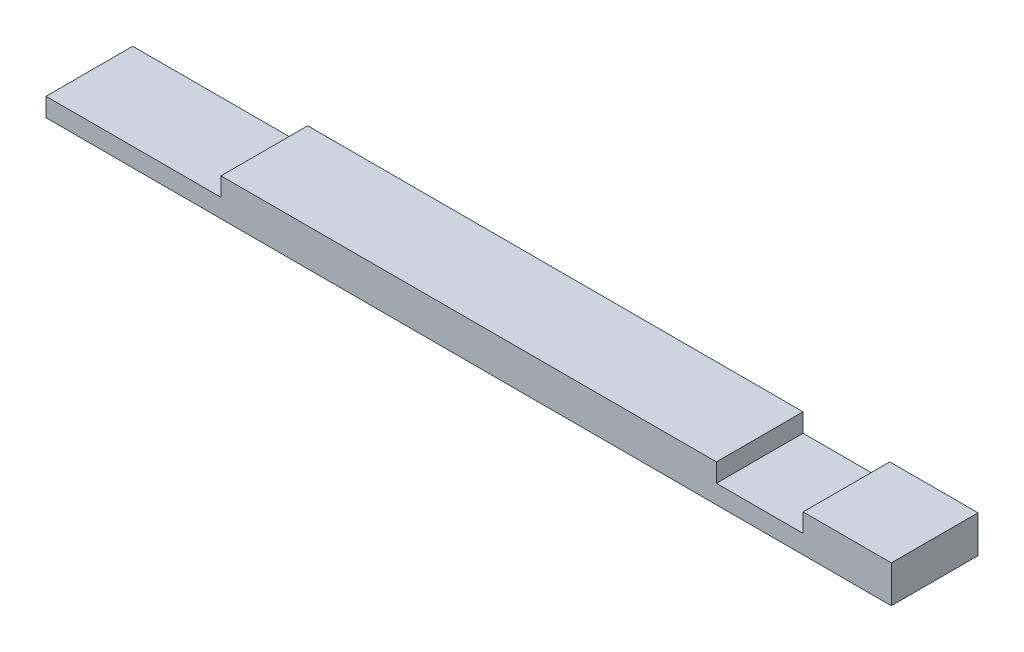
ISO-10303-21;
HEADER;
FILE_DESCRIPTION(('STEP AP214'),'2;1');
FILE_NAME('part.step','',(''),(''),'','','');
FILE_SCHEMA(('AUTOMOTIVE_DESIGN { 1 0 10303 214 1 1 1 1 }'));
ENDSEC;
DATA;
#1=APPLICATION_CONTEXT('core data for automotive mechanical design processes');
#2=APPLICATION_PROTOCOL_DEFINITION('international standard','automotive_design',2000,#1);
#3=PRODUCT_CONTEXT('',#1,'mechanical');
#4=PRODUCT('Part','Part','',(#3));
#5=PRODUCT_RELATED_PRODUCT_CATEGORY('part','',(#4));
#6=PRODUCT_DEFINITION_FORMATION('','',#4);
#7=PRODUCT_DEFINITION_CONTEXT('part definition',#1,'design');
#8=PRODUCT_DEFINITION('design','',#6,#7);
#9=PRODUCT_DEFINITION_SHAPE('','',#8);
#10=(LENGTH_UNIT() NAMED_UNIT(*) SI_UNIT(.MILLI.,.METRE.));
#11=(NAMED_UNIT(*) PLANE_ANGLE_UNIT() SI_UNIT($,.RADIAN.));
#12=(NAMED_UNIT(*) SI_UNIT($,.STERADIAN.) SOLID_ANGLE_UNIT());
#13=UNCERTAINTY_MEASURE_WITH_UNIT(LENGTH_MEASURE(1.E-05),#10,'distance_accuracy_value','');
#14=(GEOMETRIC_REPRESENTATION_CONTEXT(3) GLOBAL_UNCERTAINTY_ASSIGNED_CONTEXT((#13)) GLOBAL_UNIT_ASSIGNED_CONTEXT((#10,
#11,#12)) REPRESENTATION_CONTEXT('',''));
#15=CARTESIAN_POINT('',(0.,0.,0.));
#16=DIRECTION('',(0.,0.,1.));
#17=DIRECTION('',(1.,0.,0.));
#18=AXIS2_PLACEMENT_3D('',#15,#16,#17);
#19=CARTESIAN_POINT('',(0.,38.1,0.));
#20=DIRECTION('',(1.,0.,0.));
#21=DIRECTION('',(0.,0.,-1.));
#22=AXIS2_PLACEMENT_3D('',#19,#20,#21);
#23=PLANE('',#22);
#24=DIRECTION('',(0.,0.,1.));
#25=VECTOR('',#24,1.);
#26=CARTESIAN_POINT('',(0.,19.05,0.));
#27=LINE('',#26,#25);
#28=CARTESIAN_POINT('',(0.,19.05,-88.9));
#29=VERTEX_POINT('',#28);
#30=CARTESIAN_POINT('',(0.,19.05,0.));
#31=VERTEX_POINT('',#30);
#32=EDGE_CURVE('E161',#29,#31,#27,.T.);
#33=ORIENTED_EDGE('',*,*,#32,.F.);
#34=DIRECTION('',(0.,-1.,0.));
#35=VECTOR('',#34,1.);
#36=CARTESIAN_POINT('',(0.,38.1,-88.9));
#37=LINE('',#36,#35);
#38=CARTESIAN_POINT('',(0.,0.,-88.9));
#39=VERTEX_POINT('',#38);
#40=EDGE_CURVE('E176',#29,#39,#37,.T.);
#41=ORIENTED_EDGE('',*,*,#40,.T.);
#42=DIRECTION('',(0.,0.,1.));
#43=VECTOR('',#42,1.);
#44=CARTESIAN_POINT('',(0.,0.,0.));
#45=LINE('',#44,#43);
#46=CARTESIAN_POINT('',(0.,0.,0.));
#47=VERTEX_POINT('',#46);
#48=EDGE_CURVE('E147',#39,#47,#45,.T.);
#49=ORIENTED_EDGE('',*,*,#48,.T.);
#50=DIRECTION('',(0.,-1.,0.));
#51=VECTOR('',#50,1.);
#52=CARTESIAN_POINT('',(0.,38.1,0.));
#53=LINE('',#52,#51);
#54=EDGE_CURVE('E11',#31,#47,#53,.T.);
#55=ORIENTED_EDGE('',*,*,#54,.F.);
#56=EDGE_LOOP('',(#33,#41,#49,#55));
#57=FACE_BOUND('',#56,.T.);
#58=ADVANCED_FACE('F39',(#57),#23,.F.);
#59=CARTESIAN_POINT('',(0.,38.1,0.));
#60=DIRECTION('',(0.,-1.,0.));
#61=DIRECTION('',(0.,0.,-1.));
#62=AXIS2_PLACEMENT_3D('',#59,#60,#61);
#63=PLANE('',#62);
#64=DIRECTION('',(-1.,0.,0.));
#65=VECTOR('',#64,1.);
#66=CARTESIAN_POINT('',(0.,38.1,-88.9));
#67=LINE('',#66,#65);
#68=CARTESIAN_POINT('',(866.775,38.1,-88.9));
#69=VERTEX_POINT('',#68);
#70=CARTESIAN_POINT('',(776.28750000001,38.1,-88.9));
#71=VERTEX_POINT('',#70);
#72=EDGE_CURVE('E174',#69,#71,#67,.T.);
#73=ORIENTED_EDGE('',*,*,#72,.T.);
#74=DIRECTION('',(0.,0.,-1.));
#75=VECTOR('',#74,1.);
#76=CARTESIAN_POINT('',(776.28750000001,38.1,-4.44089209850063E-13));
#77=LINE('',#76,#75);
#78=CARTESIAN_POINT('',(776.28750000001,38.1,-4.44089209850063E-13));
#79=VERTEX_POINT('',#78);
#80=EDGE_CURVE('E119',#79,#71,#77,.T.);
#81=ORIENTED_EDGE('',*,*,#80,.F.);
#82=DIRECTION('',(1.,0.,0.));
#83=VECTOR('',#82,1.);
#84=CARTESIAN_POINT('',(0.,38.1,0.));
#85=LINE('',#84,#83);
#86=CARTESIAN_POINT('',(866.775,38.1,0.));
#87=VERTEX_POINT('',#86);
#88=EDGE_CURVE('E167',#79,#87,#85,.T.);
#89=ORIENTED_EDGE('',*,*,#88,.T.);
#90=DIRECTION('',(0.,0.,-1.));
#91=VECTOR('',#90,1.);
#92=CARTESIAN_POINT('',(866.775,38.1,0.));
#93=LINE('',#92,#91);
#94=EDGE_CURVE('E171',#87,#69,#93,.T.);
#95=ORIENTED_EDGE('',*,*,#94,.T.);
#96=EDGE_LOOP('',(#73,#81,#89,#95));
#97=FACE_BOUND('',#96,.T.);
#98=ADVANCED_FACE('F205',(#97),#63,.F.);
#99=CARTESIAN_POINT('',(0.,38.1,0.));
#100=DIRECTION('',(0.,0.,-1.));
#101=DIRECTION('',(-1.,0.,0.));
#102=AXIS2_PLACEMENT_3D('',#99,#100,#101);
#103=PLANE('',#102);
#104=ORIENTED_EDGE('',*,*,#88,.F.);
#105=DIRECTION('',(0.,1.,0.));
#106=VECTOR('',#105,1.);
#107=CARTESIAN_POINT('',(776.28750000001,19.05,-4.44089209850063E-13));
#108=LINE('',#107,#106);
#109=CARTESIAN_POINT('',(776.28750000001,19.05,-4.44089209850063E-13));
#110=VERTEX_POINT('',#109);
#111=EDGE_CURVE('E145',#110,#79,#108,.T.);
#112=ORIENTED_EDGE('',*,*,#111,.F.);
#113=DIRECTION('',(1.,0.,0.));
#114=VECTOR('',#113,1.);
#115=CARTESIAN_POINT('',(776.28750000001,19.05,-4.44089209850063E-13));
#116=LINE('',#115,#114);
#117=CARTESIAN_POINT('',(687.387500000011,19.05,-4.44089209850063E-13));
#118=VERTEX_POINT('',#117);
#119=EDGE_CURVE('E124',#118,#110,#116,.T.);
#120=ORIENTED_EDGE('',*,*,#119,.F.);
#121=DIRECTION('',(0.,1.,0.));
#122=VECTOR('',#121,1.);
#123=CARTESIAN_POINT('',(687.387500000011,19.05,-4.44089209850063E-13));
#124=LINE('',#123,#122);
#125=CARTESIAN_POINT('',(687.387500000011,38.1,-4.44089209850063E-13));
#126=VERTEX_POINT('',#125);
#127=EDGE_CURVE('E148',#118,#126,#124,.T.);
#128=ORIENTED_EDGE('',*,*,#127,.T.);
#129=CARTESIAN_POINT('',(179.400200000003,38.1,0.));
#130=VERTEX_POINT('',#129);
#131=EDGE_CURVE('E169',#130,#126,#85,.T.);
#132=ORIENTED_EDGE('',*,*,#131,.F.);
#133=DIRECTION('',(0.,1.,0.));
#134=VECTOR('',#133,1.);
#135=CARTESIAN_POINT('',(179.400200000003,19.05,0.));
#136=LINE('',#135,#134);
#137=CARTESIAN_POINT('',(179.400200000003,19.05,0.));
#138=VERTEX_POINT('',#137);
#139=EDGE_CURVE('E61',#138,#130,#136,.T.);
#140=ORIENTED_EDGE('',*,*,#139,.F.);
#141=DIRECTION('',(1.,0.,0.));
#142=VECTOR('',#141,1.);
#143=CARTESIAN_POINT('',(179.400200000003,19.05,0.));
#144=LINE('',#143,#142);
#145=EDGE_CURVE('E155',#31,#138,#144,.T.);
#146=ORIENTED_EDGE('',*,*,#145,.F.);
#147=ORIENTED_EDGE('',*,*,#54,.T.);
#148=DIRECTION('',(1.,0.,0.));
#149=VECTOR('',#148,1.);
#150=CARTESIAN_POINT('',(0.,0.,0.));
#151=LINE('',#150,#149);
#152=CARTESIAN_POINT('',(866.775,0.,0.));
#153=VERTEX_POINT('',#152);
#154=EDGE_CURVE('E179',#47,#153,#151,.T.);
#155=ORIENTED_EDGE('',*,*,#154,.T.);
#156=DIRECTION('',(0.,-1.,0.));
#157=VECTOR('',#156,1.);
#158=CARTESIAN_POINT('',(866.775,38.1,0.));
#159=LINE('',#158,#157);
#160=EDGE_CURVE('E46',#87,#153,#159,.T.);
#161=ORIENTED_EDGE('',*,*,#160,.F.);
#162=EDGE_LOOP('',(#104,#112,#120,#128,#132,#140,#146,#147,#155,#161));
#163=FACE_BOUND('',#162,.T.);
#164=ADVANCED_FACE('F206',(#163),#103,.F.);
#165=CARTESIAN_POINT('',(866.775,38.1,0.));
#166=DIRECTION('',(-1.,0.,0.));
#167=DIRECTION('',(0.,0.,1.));
#168=AXIS2_PLACEMENT_3D('',#165,#166,#167);
#169=PLANE('',#168);
#170=DIRECTION('',(0.,0.,-1.));
#171=VECTOR('',#170,1.);
#172=CARTESIAN_POINT('',(866.775,0.,0.));
#173=LINE('',#172,#171);
#174=CARTESIAN_POINT('',(866.775,0.,-88.9));
#175=VERTEX_POINT('',#174);
#176=EDGE_CURVE('E181',#153,#175,#173,.T.);
#177=ORIENTED_EDGE('',*,*,#176,.T.);
#178=DIRECTION('',(0.,-1.,0.));
#179=VECTOR('',#178,1.);
#180=CARTESIAN_POINT('',(866.775,38.1,-88.9));
#181=LINE('',#180,#179);
#182=EDGE_CURVE('E186',#69,#175,#181,.T.);
#183=ORIENTED_EDGE('',*,*,#182,.F.);
#184=ORIENTED_EDGE('',*,*,#94,.F.);
#185=ORIENTED_EDGE('',*,*,#160,.T.);
#186=EDGE_LOOP('',(#177,#183,#184,#185));
#187=FACE_BOUND('',#186,.T.);
#188=ADVANCED_FACE('F193',(#187),#169,.F.);
#189=CARTESIAN_POINT('',(0.,38.1,-88.9));
#190=DIRECTION('',(0.,0.,1.));
#191=DIRECTION('',(1.,0.,0.));
#192=AXIS2_PLACEMENT_3D('',#189,#190,#191);
#193=PLANE('',#192);
#194=DIRECTION('',(-1.,0.,0.));
#195=VECTOR('',#194,1.);
#196=CARTESIAN_POINT('',(776.28750000001,19.05,-88.9));
#197=LINE('',#196,#195);
#198=CARTESIAN_POINT('',(776.28750000001,19.05,-88.9));
#199=VERTEX_POINT('',#198);
#200=CARTESIAN_POINT('',(687.387500000011,19.05,-88.9));
#201=VERTEX_POINT('',#200);
#202=EDGE_CURVE('E130',#199,#201,#197,.T.);
#203=ORIENTED_EDGE('',*,*,#202,.F.);
#204=DIRECTION('',(0.,1.,0.));
#205=VECTOR('',#204,1.);
#206=CARTESIAN_POINT('',(776.28750000001,19.05,-88.9));
#207=LINE('',#206,#205);
#208=EDGE_CURVE('E113',#199,#71,#207,.T.);
#209=ORIENTED_EDGE('',*,*,#208,.T.);
#210=ORIENTED_EDGE('',*,*,#72,.F.);
#211=ORIENTED_EDGE('',*,*,#182,.T.);
#212=DIRECTION('',(-1.,0.,0.));
#213=VECTOR('',#212,1.);
#214=CARTESIAN_POINT('',(0.,0.,-88.9));
#215=LINE('',#214,#213);
#216=EDGE_CURVE('E170',#175,#39,#215,.T.);
#217=ORIENTED_EDGE('',*,*,#216,.T.);
#218=ORIENTED_EDGE('',*,*,#40,.F.);
#219=DIRECTION('',(-1.,0.,0.));
#220=VECTOR('',#219,1.);
#221=CARTESIAN_POINT('',(179.400200000003,19.05,-88.9));
#222=LINE('',#221,#220);
#223=CARTESIAN_POINT('',(179.400200000003,19.05,-88.9));
#224=VERTEX_POINT('',#223);
#225=EDGE_CURVE('E163',#224,#29,#222,.T.);
#226=ORIENTED_EDGE('',*,*,#225,.F.);
#227=DIRECTION('',(0.,1.,0.));
#228=VECTOR('',#227,1.);
#229=CARTESIAN_POINT('',(179.400200000003,19.05,-88.9));
#230=LINE('',#229,#228);
#231=CARTESIAN_POINT('',(179.400200000003,38.1,-88.9));
#232=VERTEX_POINT('',#231);
#233=EDGE_CURVE('E152',#224,#232,#230,.T.);
#234=ORIENTED_EDGE('',*,*,#233,.T.);
#235=CARTESIAN_POINT('',(687.38750000001,38.1,-88.9));
#236=VERTEX_POINT('',#235);
#237=EDGE_CURVE('E173',#236,#232,#67,.T.);
#238=ORIENTED_EDGE('',*,*,#237,.F.);
#239=DIRECTION('',(0.,1.,0.));
#240=VECTOR('',#239,1.);
#241=CARTESIAN_POINT('',(687.387500000011,19.05,-88.9));
#242=LINE('',#241,#240);
#243=EDGE_CURVE('E53',#201,#236,#242,.T.);
#244=ORIENTED_EDGE('',*,*,#243,.F.);
#245=EDGE_LOOP('',(#203,#209,#210,#211,#217,#218,#226,#234,#238,#244));
#246=FACE_BOUND('',#245,.T.);
#247=ADVANCED_FACE('F135',(#246),#193,.F.);
#248=ORIENTED_EDGE('',*,*,#131,.T.);
#249=DIRECTION('',(0.,0.,1.));
#250=VECTOR('',#249,1.);
#251=CARTESIAN_POINT('',(687.387500000011,38.1,-4.44089209850063E-13));
#252=LINE('',#251,#250);
#253=EDGE_CURVE('E133',#236,#126,#252,.T.);
#254=ORIENTED_EDGE('',*,*,#253,.F.);
#255=ORIENTED_EDGE('',*,*,#237,.T.);
#256=DIRECTION('',(0.,0.,-1.));
#257=VECTOR('',#256,1.);
#258=CARTESIAN_POINT('',(179.400200000003,38.1,0.));
#259=LINE('',#258,#257);
#260=EDGE_CURVE('E143',#130,#232,#259,.T.);
#261=ORIENTED_EDGE('',*,*,#260,.F.);
#262=EDGE_LOOP('',(#248,#254,#255,#261));
#263=FACE_BOUND('',#262,.T.);
#264=ADVANCED_FACE('F210',(#263),#63,.F.);
#265=CARTESIAN_POINT('',(0.,0.,0.));
#266=DIRECTION('',(0.,-1.,0.));
#267=DIRECTION('',(0.,0.,-1.));
#268=AXIS2_PLACEMENT_3D('',#265,#266,#267);
#269=PLANE('',#268);
#270=ORIENTED_EDGE('',*,*,#48,.F.);
#271=ORIENTED_EDGE('',*,*,#216,.F.);
#272=ORIENTED_EDGE('',*,*,#176,.F.);
#273=ORIENTED_EDGE('',*,*,#154,.F.);
#274=EDGE_LOOP('',(#270,#271,#272,#273));
#275=FACE_BOUND('',#274,.T.);
#276=ADVANCED_FACE('F201',(#275),#269,.T.);
#277=CARTESIAN_POINT('',(179.400200000003,19.05,0.));
#278=DIRECTION('',(1.,0.,0.));
#279=DIRECTION('',(0.,0.,-1.));
#280=AXIS2_PLACEMENT_3D('',#277,#278,#279);
#281=PLANE('',#280);
#282=ORIENTED_EDGE('',*,*,#260,.T.);
#283=ORIENTED_EDGE('',*,*,#233,.F.);
#284=DIRECTION('',(0.,0.,-1.));
#285=VECTOR('',#284,1.);
#286=CARTESIAN_POINT('',(179.400200000003,19.05,0.));
#287=LINE('',#286,#285);
#288=EDGE_CURVE('E158',#138,#224,#287,.T.);
#289=ORIENTED_EDGE('',*,*,#288,.F.);
#290=ORIENTED_EDGE('',*,*,#139,.T.);
#291=EDGE_LOOP('',(#282,#283,#289,#290));
#292=FACE_BOUND('',#291,.T.);
#293=ADVANCED_FACE('F212',(#292),#281,.F.);
#294=CARTESIAN_POINT('',(0.,19.05,0.));
#295=DIRECTION('',(0.,1.,0.));
#296=DIRECTION('',(0.,0.,1.));
#297=AXIS2_PLACEMENT_3D('',#294,#295,#296);
#298=PLANE('',#297);
#299=ORIENTED_EDGE('',*,*,#288,.T.);
#300=ORIENTED_EDGE('',*,*,#225,.T.);
#301=ORIENTED_EDGE('',*,*,#32,.T.);
#302=ORIENTED_EDGE('',*,*,#145,.T.);
#303=EDGE_LOOP('',(#299,#300,#301,#302));
#304=FACE_BOUND('',#303,.T.);
#305=ADVANCED_FACE('F215',(#304),#298,.T.);
#306=CARTESIAN_POINT('',(776.28750000001,19.05,-4.44089209850063E-13));
#307=DIRECTION('',(1.,0.,0.));
#308=DIRECTION('',(0.,0.,-1.));
#309=AXIS2_PLACEMENT_3D('',#306,#307,#308);
#310=PLANE('',#309);
#311=ORIENTED_EDGE('',*,*,#80,.T.);
#312=ORIENTED_EDGE('',*,*,#208,.F.);
#313=DIRECTION('',(0.,0.,-1.));
#314=VECTOR('',#313,1.);
#315=CARTESIAN_POINT('',(776.28750000001,19.05,-4.44089209850063E-13));
#316=LINE('',#315,#314);
#317=EDGE_CURVE('E116',#110,#199,#316,.T.);
#318=ORIENTED_EDGE('',*,*,#317,.F.);
#319=ORIENTED_EDGE('',*,*,#111,.T.);
#320=EDGE_LOOP('',(#311,#312,#318,#319));
#321=FACE_BOUND('',#320,.T.);
#322=ADVANCED_FACE('F115',(#321),#310,.F.);
#323=CARTESIAN_POINT('',(687.387500000011,19.05,-4.44089209850063E-13));
#324=DIRECTION('',(-1.,0.,0.));
#325=DIRECTION('',(0.,0.,1.));
#326=AXIS2_PLACEMENT_3D('',#323,#324,#325);
#327=PLANE('',#326);
#328=ORIENTED_EDGE('',*,*,#253,.T.);
#329=ORIENTED_EDGE('',*,*,#127,.F.);
#330=DIRECTION('',(0.,0.,1.));
#331=VECTOR('',#330,1.);
#332=CARTESIAN_POINT('',(687.387500000011,19.05,-4.44089209850063E-13));
#333=LINE('',#332,#331);
#334=EDGE_CURVE('E137',#201,#118,#333,.T.);
#335=ORIENTED_EDGE('',*,*,#334,.F.);
#336=ORIENTED_EDGE('',*,*,#243,.T.);
#337=EDGE_LOOP('',(#328,#329,#335,#336));
#338=FACE_BOUND('',#337,.T.);
#339=ADVANCED_FACE('F283',(#338),#327,.F.);
#340=CARTESIAN_POINT('',(0.,19.05,0.));
#341=DIRECTION('',(0.,1.,0.));
#342=DIRECTION('',(0.,0.,1.));
#343=AXIS2_PLACEMENT_3D('',#340,#341,#342);
#344=PLANE('',#343);
#345=ORIENTED_EDGE('',*,*,#317,.T.);
#346=ORIENTED_EDGE('',*,*,#202,.T.);
#347=ORIENTED_EDGE('',*,*,#334,.T.);
#348=ORIENTED_EDGE('',*,*,#119,.T.);
#349=EDGE_LOOP('',(#345,#346,#347,#348));
#350=FACE_BOUND('',#349,.T.);
#351=ADVANCED_FACE('F128',(#350),#344,.T.);
#352=CLOSED_SHELL('',(#58,#98,#164,#188,#247,#264,#276,#293,#305,#322,#339,#351));
#353=MANIFOLD_SOLID_BREP('B2',#352);
#354=ADVANCED_BREP_SHAPE_REPRESENTATION('',(#18,#353),#14);
#355=SHAPE_DEFINITION_REPRESENTATION(#9,#354);
ENDSEC;
END-ISO-10303-21;
